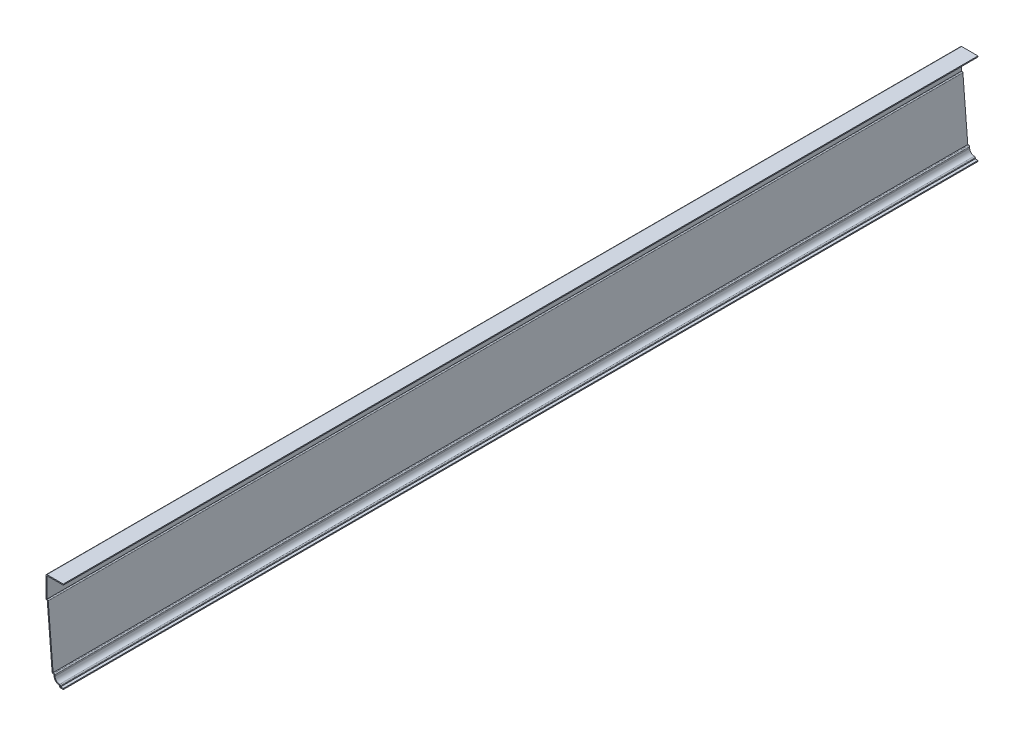
ISO-10303-21;
HEADER;
FILE_DESCRIPTION(('STEP AP214'),'2;1');
FILE_NAME('part.step','',(''),(''),'','','');
FILE_SCHEMA(('AUTOMOTIVE_DESIGN { 1 0 10303 214 1 1 1 1 }'));
ENDSEC;
DATA;
#1=APPLICATION_CONTEXT('core data for automotive mechanical design processes');
#2=APPLICATION_PROTOCOL_DEFINITION('international standard','automotive_design',2000,#1);
#3=PRODUCT_CONTEXT('',#1,'mechanical');
#4=PRODUCT('Part','Part','',(#3));
#5=PRODUCT_RELATED_PRODUCT_CATEGORY('part','',(#4));
#6=PRODUCT_DEFINITION_FORMATION('','',#4);
#7=PRODUCT_DEFINITION_CONTEXT('part definition',#1,'design');
#8=PRODUCT_DEFINITION('design','',#6,#7);
#9=PRODUCT_DEFINITION_SHAPE('','',#8);
#10=(LENGTH_UNIT() NAMED_UNIT(*) SI_UNIT(.MILLI.,.METRE.));
#11=(NAMED_UNIT(*) PLANE_ANGLE_UNIT() SI_UNIT($,.RADIAN.));
#12=(NAMED_UNIT(*) SI_UNIT($,.STERADIAN.) SOLID_ANGLE_UNIT());
#13=UNCERTAINTY_MEASURE_WITH_UNIT(LENGTH_MEASURE(1.E-05),#10,'distance_accuracy_value','');
#14=(GEOMETRIC_REPRESENTATION_CONTEXT(3) GLOBAL_UNCERTAINTY_ASSIGNED_CONTEXT((#13)) GLOBAL_UNIT_ASSIGNED_CONTEXT((#10,
#11,#12)) REPRESENTATION_CONTEXT('',''));
#15=CARTESIAN_POINT('',(0.,0.,0.));
#16=DIRECTION('',(0.,0.,1.));
#17=DIRECTION('',(1.,0.,0.));
#18=AXIS2_PLACEMENT_3D('',#15,#16,#17);
#19=CARTESIAN_POINT('',(-22.225,116.205,-1174.75));
#20=DIRECTION('',(0.,-1.,0.));
#21=DIRECTION('',(0.,0.,-1.));
#22=AXIS2_PLACEMENT_3D('',#19,#20,#21);
#23=PLANE('',#22);
#24=DIRECTION('',(1.,0.,0.));
#25=VECTOR('',#24,1.);
#26=CARTESIAN_POINT('',(-22.225,116.205,0.));
#27=LINE('',#26,#25);
#28=CARTESIAN_POINT('',(-20.955,116.205,0.));
#29=VERTEX_POINT('',#28);
#30=CARTESIAN_POINT('',(0.,116.205,0.));
#31=VERTEX_POINT('',#30);
#32=EDGE_CURVE('E286',#29,#31,#27,.T.);
#33=ORIENTED_EDGE('',*,*,#32,.F.);
#34=DIRECTION('',(0.,0.,1.));
#35=VECTOR('',#34,1.);
#36=CARTESIAN_POINT('',(-20.955,116.205,-1174.75));
#37=LINE('',#36,#35);
#38=CARTESIAN_POINT('',(-20.955,116.205,-1174.75));
#39=VERTEX_POINT('',#38);
#40=EDGE_CURVE('E239',#39,#29,#37,.T.);
#41=ORIENTED_EDGE('',*,*,#40,.F.);
#42=DIRECTION('',(1.,0.,0.));
#43=VECTOR('',#42,1.);
#44=CARTESIAN_POINT('',(-22.225,116.205,-1174.75));
#45=LINE('',#44,#43);
#46=CARTESIAN_POINT('',(0.,116.205,-1174.75));
#47=VERTEX_POINT('',#46);
#48=EDGE_CURVE('E221',#39,#47,#45,.T.);
#49=ORIENTED_EDGE('',*,*,#48,.T.);
#50=DIRECTION('',(0.,0.,1.));
#51=VECTOR('',#50,1.);
#52=CARTESIAN_POINT('',(0.,116.205,-1174.75));
#53=LINE('',#52,#51);
#54=EDGE_CURVE('E229',#47,#31,#53,.T.);
#55=ORIENTED_EDGE('',*,*,#54,.T.);
#56=EDGE_LOOP('',(#33,#41,#49,#55));
#57=FACE_BOUND('',#56,.T.);
#58=ADVANCED_FACE('F35',(#57),#23,.T.);
#59=CARTESIAN_POINT('',(-20.955,88.9,-1174.75));
#60=DIRECTION('',(1.,0.,0.));
#61=DIRECTION('',(0.,1.,0.));
#62=AXIS2_PLACEMENT_3D('',#59,#60,#61);
#63=PLANE('',#62);
#64=DIRECTION('',(0.,1.,0.));
#65=VECTOR('',#64,1.);
#66=CARTESIAN_POINT('',(-20.955,88.9,0.));
#67=LINE('',#66,#65);
#68=CARTESIAN_POINT('',(-20.955,90.17,0.));
#69=VERTEX_POINT('',#68);
#70=EDGE_CURVE('E240',#69,#29,#67,.T.);
#71=ORIENTED_EDGE('',*,*,#70,.F.);
#72=DIRECTION('',(0.,0.,1.));
#73=VECTOR('',#72,1.);
#74=CARTESIAN_POINT('',(-20.955,90.17,-1174.75));
#75=LINE('',#74,#73);
#76=CARTESIAN_POINT('',(-20.955,90.17,-1174.75));
#77=VERTEX_POINT('',#76);
#78=EDGE_CURVE('E331',#77,#69,#75,.T.);
#79=ORIENTED_EDGE('',*,*,#78,.F.);
#80=DIRECTION('',(0.,1.,0.));
#81=VECTOR('',#80,1.);
#82=CARTESIAN_POINT('',(-20.955,88.9,-1174.75));
#83=LINE('',#82,#81);
#84=EDGE_CURVE('E237',#77,#39,#83,.T.);
#85=ORIENTED_EDGE('',*,*,#84,.T.);
#86=ORIENTED_EDGE('',*,*,#40,.T.);
#87=EDGE_LOOP('',(#71,#79,#85,#86));
#88=FACE_BOUND('',#87,.T.);
#89=ADVANCED_FACE('F523',(#88),#63,.T.);
#90=CARTESIAN_POINT('',(-20.6375,90.17,-1174.75));
#91=DIRECTION('',(0.,1.,0.));
#92=DIRECTION('',(0.,0.,1.));
#93=AXIS2_PLACEMENT_3D('',#90,#91,#92);
#94=PLANE('',#93);
#95=DIRECTION('',(1.,0.,0.));
#96=VECTOR('',#95,1.);
#97=CARTESIAN_POINT('',(-20.6375,90.17,0.));
#98=LINE('',#97,#96);
#99=CARTESIAN_POINT('',(-20.6375,90.17,0.));
#100=VERTEX_POINT('',#99);
#101=EDGE_CURVE('E243',#100,#69,#98,.F.);
#102=ORIENTED_EDGE('',*,*,#101,.F.);
#103=DIRECTION('',(0.,0.,1.));
#104=VECTOR('',#103,1.);
#105=CARTESIAN_POINT('',(-20.6375,90.17,-1174.75));
#106=LINE('',#105,#104);
#107=CARTESIAN_POINT('',(-20.6375,90.17,-1174.75));
#108=VERTEX_POINT('',#107);
#109=EDGE_CURVE('E43',#100,#108,#106,.F.);
#110=ORIENTED_EDGE('',*,*,#109,.T.);
#111=DIRECTION('',(1.,0.,0.));
#112=VECTOR('',#111,1.);
#113=CARTESIAN_POINT('',(-20.6375,90.17,-1174.75));
#114=LINE('',#113,#112);
#115=EDGE_CURVE('E283',#108,#77,#114,.F.);
#116=ORIENTED_EDGE('',*,*,#115,.T.);
#117=ORIENTED_EDGE('',*,*,#78,.T.);
#118=EDGE_LOOP('',(#102,#110,#116,#117));
#119=FACE_BOUND('',#118,.T.);
#120=ADVANCED_FACE('F418',(#119),#94,.T.);
#121=CARTESIAN_POINT('',(-13.0217105379053,11.2158297520077,-1174.75));
#122=DIRECTION('',(0.996684615822608,0.0813620094549069,0.));
#123=DIRECTION('',(-0.0813620094549069,0.996684615822608,0.));
#124=AXIS2_PLACEMENT_3D('',#121,#122,#123);
#125=PLANE('',#124);
#126=DIRECTION('',(-0.0813620094549069,0.996684615822608,0.));
#127=VECTOR('',#126,1.);
#128=CARTESIAN_POINT('',(-13.0217105379053,11.2158297520077,-1174.75));
#129=LINE('',#128,#127);
#130=CARTESIAN_POINT('',(-13.1169489254965,12.3825,-1174.75));
#131=VERTEX_POINT('',#130);
#132=CARTESIAN_POINT('',(-19.3717105379053,89.0033297520077,-1174.75));
#133=VERTEX_POINT('',#132);
#134=EDGE_CURVE('E280',#131,#133,#129,.T.);
#135=ORIENTED_EDGE('',*,*,#134,.T.);
#136=DIRECTION('',(0.,0.,1.));
#137=VECTOR('',#136,1.);
#138=CARTESIAN_POINT('',(-19.3717105379053,89.0033297520077,-1174.75));
#139=LINE('',#138,#137);
#140=CARTESIAN_POINT('',(-19.3717105379053,89.0033297520077,0.));
#141=VERTEX_POINT('',#140);
#142=EDGE_CURVE('E412',#133,#141,#139,.T.);
#143=ORIENTED_EDGE('',*,*,#142,.T.);
#144=DIRECTION('',(-0.0813620094549069,0.996684615822608,0.));
#145=VECTOR('',#144,1.);
#146=CARTESIAN_POINT('',(-13.0217105379053,11.2158297520077,0.));
#147=LINE('',#146,#145);
#148=CARTESIAN_POINT('',(-13.1169489254965,12.3825,0.));
#149=VERTEX_POINT('',#148);
#150=EDGE_CURVE('E325',#149,#141,#147,.T.);
#151=ORIENTED_EDGE('',*,*,#150,.F.);
#152=DIRECTION('',(0.,0.,1.));
#153=VECTOR('',#152,1.);
#154=CARTESIAN_POINT('',(-13.1169489254965,12.3825,-1174.75));
#155=LINE('',#154,#153);
#156=EDGE_CURVE('E334',#131,#149,#155,.T.);
#157=ORIENTED_EDGE('',*,*,#156,.F.);
#158=EDGE_LOOP('',(#135,#143,#151,#157));
#159=FACE_BOUND('',#158,.T.);
#160=ADVANCED_FACE('F427',(#159),#125,.T.);
#161=CARTESIAN_POINT('',(-11.90625,12.3825,-1174.75));
#162=DIRECTION('',(0.,1.,0.));
#163=DIRECTION('',(-1.,0.,0.));
#164=AXIS2_PLACEMENT_3D('',#161,#162,#163);
#165=PLANE('',#164);
#166=DIRECTION('',(-1.,0.,0.));
#167=VECTOR('',#166,1.);
#168=CARTESIAN_POINT('',(-11.90625,12.3825,0.));
#169=LINE('',#168,#167);
#170=CARTESIAN_POINT('',(-11.90625,12.3825,0.));
#171=VERTEX_POINT('',#170);
#172=EDGE_CURVE('E323',#171,#149,#169,.T.);
#173=ORIENTED_EDGE('',*,*,#172,.F.);
#174=DIRECTION('',(0.,0.,1.));
#175=VECTOR('',#174,1.);
#176=CARTESIAN_POINT('',(-11.90625,12.3825,-1174.75));
#177=LINE('',#176,#175);
#178=CARTESIAN_POINT('',(-11.90625,12.3825,-1174.75));
#179=VERTEX_POINT('',#178);
#180=EDGE_CURVE('E399',#171,#179,#177,.F.);
#181=ORIENTED_EDGE('',*,*,#180,.T.);
#182=DIRECTION('',(-1.,0.,0.));
#183=VECTOR('',#182,1.);
#184=CARTESIAN_POINT('',(-11.90625,12.3825,-1174.75));
#185=LINE('',#184,#183);
#186=EDGE_CURVE('E278',#179,#131,#185,.T.);
#187=ORIENTED_EDGE('',*,*,#186,.T.);
#188=ORIENTED_EDGE('',*,*,#156,.T.);
#189=EDGE_LOOP('',(#173,#181,#187,#188));
#190=FACE_BOUND('',#189,.T.);
#191=ADVANCED_FACE('F435',(#190),#165,.T.);
#192=CARTESIAN_POINT('',(-10.63625,9.525,-1174.75));
#193=DIRECTION('',(1.,0.,0.));
#194=DIRECTION('',(0.,0.,-1.));
#195=AXIS2_PLACEMENT_3D('',#192,#193,#194);
#196=PLANE('',#195);
#197=DIRECTION('',(0.,1.,0.));
#198=VECTOR('',#197,1.);
#199=CARTESIAN_POINT('',(-10.63625,9.525,-1174.75));
#200=LINE('',#199,#198);
#201=CARTESIAN_POINT('',(-10.63625,9.525,-1174.75));
#202=VERTEX_POINT('',#201);
#203=CARTESIAN_POINT('',(-10.63625,11.1125,-1174.75));
#204=VERTEX_POINT('',#203);
#205=EDGE_CURVE('E275',#202,#204,#200,.T.);
#206=ORIENTED_EDGE('',*,*,#205,.T.);
#207=DIRECTION('',(0.,0.,1.));
#208=VECTOR('',#207,1.);
#209=CARTESIAN_POINT('',(-10.63625,11.1125,-1174.75));
#210=LINE('',#209,#208);
#211=CARTESIAN_POINT('',(-10.63625,11.1125,0.));
#212=VERTEX_POINT('',#211);
#213=EDGE_CURVE('E396',#204,#212,#210,.T.);
#214=ORIENTED_EDGE('',*,*,#213,.T.);
#215=DIRECTION('',(0.,1.,0.));
#216=VECTOR('',#215,1.);
#217=CARTESIAN_POINT('',(-10.63625,9.525,0.));
#218=LINE('',#217,#216);
#219=CARTESIAN_POINT('',(-10.63625,9.525,0.));
#220=VERTEX_POINT('',#219);
#221=EDGE_CURVE('E320',#220,#212,#218,.T.);
#222=ORIENTED_EDGE('',*,*,#221,.F.);
#223=DIRECTION('',(0.,0.,1.));
#224=VECTOR('',#223,1.);
#225=CARTESIAN_POINT('',(-10.63625,9.525,-1174.75));
#226=LINE('',#225,#224);
#227=EDGE_CURVE('E337',#202,#220,#226,.T.);
#228=ORIENTED_EDGE('',*,*,#227,.F.);
#229=EDGE_LOOP('',(#206,#214,#222,#228));
#230=FACE_BOUND('',#229,.T.);
#231=ADVANCED_FACE('F444',(#230),#196,.T.);
#232=CARTESIAN_POINT('',(-4.7625,9.525,-1174.75));
#233=DIRECTION('',(0.,0.,1.));
#234=DIRECTION('',(1.,0.,0.));
#235=AXIS2_PLACEMENT_3D('',#232,#233,#234);
#236=CYLINDRICAL_SURFACE('',#235,5.87375);
#237=CARTESIAN_POINT('',(-4.7625,9.525,0.));
#238=DIRECTION('',(0.,0.,1.));
#239=DIRECTION('',(1.,0.,0.));
#240=AXIS2_PLACEMENT_3D('',#237,#238,#239);
#241=CIRCLE('',#240,5.87375);
#242=CARTESIAN_POINT('',(-4.7625,3.65125,0.));
#243=VERTEX_POINT('',#242);
#244=EDGE_CURVE('E318',#243,#220,#241,.F.);
#245=ORIENTED_EDGE('',*,*,#244,.F.);
#246=DIRECTION('',(0.,0.,1.));
#247=VECTOR('',#246,1.);
#248=CARTESIAN_POINT('',(-4.7625,3.65125,-1174.75));
#249=LINE('',#248,#247);
#250=CARTESIAN_POINT('',(-4.7625,3.65125,-1174.75));
#251=VERTEX_POINT('',#250);
#252=EDGE_CURVE('E394',#243,#251,#249,.F.);
#253=ORIENTED_EDGE('',*,*,#252,.T.);
#254=CARTESIAN_POINT('',(-4.7625,9.525,-1174.75));
#255=DIRECTION('',(0.,0.,1.));
#256=DIRECTION('',(1.,0.,0.));
#257=AXIS2_PLACEMENT_3D('',#254,#255,#256);
#258=CIRCLE('',#257,5.87375);
#259=EDGE_CURVE('E273',#251,#202,#258,.F.);
#260=ORIENTED_EDGE('',*,*,#259,.T.);
#261=ORIENTED_EDGE('',*,*,#227,.T.);
#262=EDGE_LOOP('',(#245,#253,#260,#261));
#263=FACE_BOUND('',#262,.T.);
#264=ADVANCED_FACE('F449',(#263),#236,.F.);
#265=CARTESIAN_POINT('',(-3.4925,0.,-1174.75));
#266=DIRECTION('',(1.,0.,0.));
#267=DIRECTION('',(0.,0.,-1.));
#268=AXIS2_PLACEMENT_3D('',#265,#266,#267);
#269=PLANE('',#268);
#270=DIRECTION('',(0.,1.,0.));
#271=VECTOR('',#270,1.);
#272=CARTESIAN_POINT('',(-3.4925,0.,-1174.75));
#273=LINE('',#272,#271);
#274=CARTESIAN_POINT('',(-3.4925,1.27,-1174.75));
#275=VERTEX_POINT('',#274);
#276=CARTESIAN_POINT('',(-3.4925,2.38125,-1174.75));
#277=VERTEX_POINT('',#276);
#278=EDGE_CURVE('E270',#275,#277,#273,.T.);
#279=ORIENTED_EDGE('',*,*,#278,.T.);
#280=DIRECTION('',(0.,0.,1.));
#281=VECTOR('',#280,1.);
#282=CARTESIAN_POINT('',(-3.4925,2.38125,-1174.75));
#283=LINE('',#282,#281);
#284=CARTESIAN_POINT('',(-3.4925,2.38125,0.));
#285=VERTEX_POINT('',#284);
#286=EDGE_CURVE('E391',#277,#285,#283,.T.);
#287=ORIENTED_EDGE('',*,*,#286,.T.);
#288=DIRECTION('',(0.,1.,0.));
#289=VECTOR('',#288,1.);
#290=CARTESIAN_POINT('',(-3.4925,0.,0.));
#291=LINE('',#290,#289);
#292=CARTESIAN_POINT('',(-3.4925,1.27,0.));
#293=VERTEX_POINT('',#292);
#294=EDGE_CURVE('E315',#293,#285,#291,.T.);
#295=ORIENTED_EDGE('',*,*,#294,.F.);
#296=DIRECTION('',(0.,0.,1.));
#297=VECTOR('',#296,1.);
#298=CARTESIAN_POINT('',(-3.4925,1.27,-1174.75));
#299=LINE('',#298,#297);
#300=EDGE_CURVE('E340',#275,#293,#299,.T.);
#301=ORIENTED_EDGE('',*,*,#300,.F.);
#302=EDGE_LOOP('',(#279,#287,#295,#301));
#303=FACE_BOUND('',#302,.T.);
#304=ADVANCED_FACE('F458',(#303),#269,.T.);
#305=CARTESIAN_POINT('',(0.,1.27,-1174.75));
#306=DIRECTION('',(0.,1.,0.));
#307=DIRECTION('',(-1.,0.,0.));
#308=AXIS2_PLACEMENT_3D('',#305,#306,#307);
#309=PLANE('',#308);
#310=DIRECTION('',(-1.,0.,0.));
#311=VECTOR('',#310,1.);
#312=CARTESIAN_POINT('',(0.,1.27,0.));
#313=LINE('',#312,#311);
#314=CARTESIAN_POINT('',(0.,1.27,0.));
#315=VERTEX_POINT('',#314);
#316=EDGE_CURVE('E312',#315,#293,#313,.T.);
#317=ORIENTED_EDGE('',*,*,#316,.F.);
#318=DIRECTION('',(0.,0.,1.));
#319=VECTOR('',#318,1.);
#320=CARTESIAN_POINT('',(0.,1.27,-1174.75));
#321=LINE('',#320,#319);
#322=CARTESIAN_POINT('',(0.,1.27,-1174.75));
#323=VERTEX_POINT('',#322);
#324=EDGE_CURVE('E342',#323,#315,#321,.T.);
#325=ORIENTED_EDGE('',*,*,#324,.F.);
#326=DIRECTION('',(-1.,0.,0.));
#327=VECTOR('',#326,1.);
#328=CARTESIAN_POINT('',(0.,1.27,-1174.75));
#329=LINE('',#328,#327);
#330=EDGE_CURVE('E267',#323,#275,#329,.T.);
#331=ORIENTED_EDGE('',*,*,#330,.T.);
#332=ORIENTED_EDGE('',*,*,#300,.T.);
#333=EDGE_LOOP('',(#317,#325,#331,#332));
#334=FACE_BOUND('',#333,.T.);
#335=ADVANCED_FACE('F463',(#334),#309,.T.);
#336=CARTESIAN_POINT('',(0.,1.27,-1174.75));
#337=DIRECTION('',(-1.,0.,0.));
#338=DIRECTION('',(0.,-1.,0.));
#339=AXIS2_PLACEMENT_3D('',#336,#337,#338);
#340=PLANE('',#339);
#341=DIRECTION('',(0.,-1.,0.));
#342=VECTOR('',#341,1.);
#343=CARTESIAN_POINT('',(0.,1.27,0.));
#344=LINE('',#343,#342);
#345=CARTESIAN_POINT('',(0.,0.,0.));
#346=VERTEX_POINT('',#345);
#347=EDGE_CURVE('E310',#315,#346,#344,.T.);
#348=ORIENTED_EDGE('',*,*,#347,.T.);
#349=DIRECTION('',(0.,0.,1.));
#350=VECTOR('',#349,1.);
#351=CARTESIAN_POINT('',(0.,0.,-1174.75));
#352=LINE('',#351,#350);
#353=CARTESIAN_POINT('',(0.,0.,-1174.75));
#354=VERTEX_POINT('',#353);
#355=EDGE_CURVE('E344',#354,#346,#352,.T.);
#356=ORIENTED_EDGE('',*,*,#355,.F.);
#357=DIRECTION('',(0.,-1.,0.));
#358=VECTOR('',#357,1.);
#359=CARTESIAN_POINT('',(0.,1.27,-1174.75));
#360=LINE('',#359,#358);
#361=EDGE_CURVE('E265',#323,#354,#360,.T.);
#362=ORIENTED_EDGE('',*,*,#361,.F.);
#363=ORIENTED_EDGE('',*,*,#324,.T.);
#364=EDGE_LOOP('',(#348,#356,#362,#363));
#365=FACE_BOUND('',#364,.T.);
#366=ADVANCED_FACE('F470',(#365),#340,.F.);
#367=CARTESIAN_POINT('',(0.,0.,-1174.75));
#368=DIRECTION('',(0.,1.,0.));
#369=DIRECTION('',(-1.,0.,0.));
#370=AXIS2_PLACEMENT_3D('',#367,#368,#369);
#371=PLANE('',#370);
#372=DIRECTION('',(-1.,0.,0.));
#373=VECTOR('',#372,1.);
#374=CARTESIAN_POINT('',(0.,0.,0.));
#375=LINE('',#374,#373);
#376=CARTESIAN_POINT('',(-3.4925,0.,0.));
#377=VERTEX_POINT('',#376);
#378=EDGE_CURVE('E307',#346,#377,#375,.T.);
#379=ORIENTED_EDGE('',*,*,#378,.T.);
#380=DIRECTION('',(0.,0.,1.));
#381=VECTOR('',#380,1.);
#382=CARTESIAN_POINT('',(-3.4925,0.,-1174.75));
#383=LINE('',#382,#381);
#384=CARTESIAN_POINT('',(-3.4925,0.,-1174.75));
#385=VERTEX_POINT('',#384);
#386=EDGE_CURVE('E376',#377,#385,#383,.F.);
#387=ORIENTED_EDGE('',*,*,#386,.T.);
#388=DIRECTION('',(-1.,0.,0.));
#389=VECTOR('',#388,1.);
#390=CARTESIAN_POINT('',(0.,0.,-1174.75));
#391=LINE('',#390,#389);
#392=EDGE_CURVE('E263',#354,#385,#391,.T.);
#393=ORIENTED_EDGE('',*,*,#392,.F.);
#394=ORIENTED_EDGE('',*,*,#355,.T.);
#395=EDGE_LOOP('',(#379,#387,#393,#394));
#396=FACE_BOUND('',#395,.T.);
#397=ADVANCED_FACE('F472',(#396),#371,.F.);
#398=CARTESIAN_POINT('',(-4.7625,0.,-1174.75));
#399=DIRECTION('',(1.,0.,0.));
#400=DIRECTION('',(0.,0.,-1.));
#401=AXIS2_PLACEMENT_3D('',#398,#399,#400);
#402=PLANE('',#401);
#403=DIRECTION('',(0.,1.,0.));
#404=VECTOR('',#403,1.);
#405=CARTESIAN_POINT('',(-4.7625,0.,-1174.75));
#406=LINE('',#405,#404);
#407=CARTESIAN_POINT('',(-4.7625,1.27,-1174.75));
#408=VERTEX_POINT('',#407);
#409=CARTESIAN_POINT('',(-4.7625,2.38125,-1174.75));
#410=VERTEX_POINT('',#409);
#411=EDGE_CURVE('E261',#408,#410,#406,.T.);
#412=ORIENTED_EDGE('',*,*,#411,.F.);
#413=DIRECTION('',(0.,0.,1.));
#414=VECTOR('',#413,1.);
#415=CARTESIAN_POINT('',(-4.7625,1.27,-1174.75));
#416=LINE('',#415,#414);
#417=CARTESIAN_POINT('',(-4.7625,1.27,0.));
#418=VERTEX_POINT('',#417);
#419=EDGE_CURVE('E330',#408,#418,#416,.T.);
#420=ORIENTED_EDGE('',*,*,#419,.T.);
#421=DIRECTION('',(0.,1.,0.));
#422=VECTOR('',#421,1.);
#423=CARTESIAN_POINT('',(-4.7625,0.,0.));
#424=LINE('',#423,#422);
#425=CARTESIAN_POINT('',(-4.7625,2.38125,0.));
#426=VERTEX_POINT('',#425);
#427=EDGE_CURVE('E305',#418,#426,#424,.T.);
#428=ORIENTED_EDGE('',*,*,#427,.T.);
#429=DIRECTION('',(0.,0.,1.));
#430=VECTOR('',#429,1.);
#431=CARTESIAN_POINT('',(-4.7625,2.38125,-1174.75));
#432=LINE('',#431,#430);
#433=EDGE_CURVE('E347',#410,#426,#432,.T.);
#434=ORIENTED_EDGE('',*,*,#433,.F.);
#435=EDGE_LOOP('',(#412,#420,#428,#434));
#436=FACE_BOUND('',#435,.T.);
#437=ADVANCED_FACE('F480',(#436),#402,.F.);
#438=CARTESIAN_POINT('',(-4.7625,9.525,-1174.75));
#439=DIRECTION('',(0.,0.,1.));
#440=DIRECTION('',(1.,0.,0.));
#441=AXIS2_PLACEMENT_3D('',#438,#439,#440);
#442=CYLINDRICAL_SURFACE('',#441,7.14375);
#443=CARTESIAN_POINT('',(-4.7625,9.525,0.));
#444=DIRECTION('',(0.,0.,-1.));
#445=DIRECTION('',(-1.,0.,0.));
#446=AXIS2_PLACEMENT_3D('',#443,#444,#445);
#447=CIRCLE('',#446,7.14375);
#448=CARTESIAN_POINT('',(-11.90625,9.525,0.));
#449=VERTEX_POINT('',#448);
#450=EDGE_CURVE('E303',#426,#449,#447,.T.);
#451=ORIENTED_EDGE('',*,*,#450,.T.);
#452=DIRECTION('',(0.,0.,1.));
#453=VECTOR('',#452,1.);
#454=CARTESIAN_POINT('',(-11.90625,9.525,-1174.75));
#455=LINE('',#454,#453);
#456=CARTESIAN_POINT('',(-11.90625,9.525,-1174.75));
#457=VERTEX_POINT('',#456);
#458=EDGE_CURVE('E350',#457,#449,#455,.T.);
#459=ORIENTED_EDGE('',*,*,#458,.F.);
#460=CARTESIAN_POINT('',(-4.7625,9.525,-1174.75));
#461=DIRECTION('',(0.,0.,-1.));
#462=DIRECTION('',(-1.,0.,0.));
#463=AXIS2_PLACEMENT_3D('',#460,#461,#462);
#464=CIRCLE('',#463,7.14375);
#465=EDGE_CURVE('E259',#410,#457,#464,.T.);
#466=ORIENTED_EDGE('',*,*,#465,.F.);
#467=ORIENTED_EDGE('',*,*,#433,.T.);
#468=EDGE_LOOP('',(#451,#459,#466,#467));
#469=FACE_BOUND('',#468,.T.);
#470=ADVANCED_FACE('F485',(#469),#442,.T.);
#471=CARTESIAN_POINT('',(-11.90625,9.525,-1174.75));
#472=DIRECTION('',(1.,0.,0.));
#473=DIRECTION('',(0.,0.,-1.));
#474=AXIS2_PLACEMENT_3D('',#471,#472,#473);
#475=PLANE('',#474);
#476=DIRECTION('',(0.,1.,0.));
#477=VECTOR('',#476,1.);
#478=CARTESIAN_POINT('',(-11.90625,9.525,0.));
#479=LINE('',#478,#477);
#480=CARTESIAN_POINT('',(-11.90625,11.1125,0.));
#481=VERTEX_POINT('',#480);
#482=EDGE_CURVE('E301',#449,#481,#479,.T.);
#483=ORIENTED_EDGE('',*,*,#482,.T.);
#484=DIRECTION('',(0.,0.,1.));
#485=VECTOR('',#484,1.);
#486=CARTESIAN_POINT('',(-11.90625,11.1125,-1174.75));
#487=LINE('',#486,#485);
#488=CARTESIAN_POINT('',(-11.90625,11.1125,-1174.75));
#489=VERTEX_POINT('',#488);
#490=EDGE_CURVE('E353',#489,#481,#487,.T.);
#491=ORIENTED_EDGE('',*,*,#490,.F.);
#492=DIRECTION('',(0.,1.,0.));
#493=VECTOR('',#492,1.);
#494=CARTESIAN_POINT('',(-11.90625,9.525,-1174.75));
#495=LINE('',#494,#493);
#496=EDGE_CURVE('E257',#457,#489,#495,.T.);
#497=ORIENTED_EDGE('',*,*,#496,.F.);
#498=ORIENTED_EDGE('',*,*,#458,.T.);
#499=EDGE_LOOP('',(#483,#491,#497,#498));
#500=FACE_BOUND('',#499,.T.);
#501=ADVANCED_FACE('F491',(#500),#475,.F.);
#502=CARTESIAN_POINT('',(-11.90625,11.1125,-1174.75));
#503=DIRECTION('',(0.,1.,0.));
#504=DIRECTION('',(-1.,0.,0.));
#505=AXIS2_PLACEMENT_3D('',#502,#503,#504);
#506=PLANE('',#505);
#507=DIRECTION('',(-1.,0.,0.));
#508=VECTOR('',#507,1.);
#509=CARTESIAN_POINT('',(-11.90625,11.1125,0.));
#510=LINE('',#509,#508);
#511=CARTESIAN_POINT('',(-13.1169489254965,11.1125,0.));
#512=VERTEX_POINT('',#511);
#513=EDGE_CURVE('E298',#481,#512,#510,.T.);
#514=ORIENTED_EDGE('',*,*,#513,.T.);
#515=DIRECTION('',(0.,0.,1.));
#516=VECTOR('',#515,1.);
#517=CARTESIAN_POINT('',(-13.1169489254965,11.1125,-1174.75));
#518=LINE('',#517,#516);
#519=CARTESIAN_POINT('',(-13.1169489254965,11.1125,-1174.75));
#520=VERTEX_POINT('',#519);
#521=EDGE_CURVE('E404',#512,#520,#518,.F.);
#522=ORIENTED_EDGE('',*,*,#521,.T.);
#523=DIRECTION('',(-1.,0.,0.));
#524=VECTOR('',#523,1.);
#525=CARTESIAN_POINT('',(-11.90625,11.1125,-1174.75));
#526=LINE('',#525,#524);
#527=EDGE_CURVE('E254',#489,#520,#526,.T.);
#528=ORIENTED_EDGE('',*,*,#527,.F.);
#529=ORIENTED_EDGE('',*,*,#490,.T.);
#530=EDGE_LOOP('',(#514,#522,#528,#529));
#531=FACE_BOUND('',#530,.T.);
#532=ADVANCED_FACE('F495',(#531),#506,.F.);
#533=CARTESIAN_POINT('',(-14.2875,11.1125,-1174.75));
#534=DIRECTION('',(0.996684615822608,0.0813620094549069,0.));
#535=DIRECTION('',(-0.0813620094549069,0.996684615822608,0.));
#536=AXIS2_PLACEMENT_3D('',#533,#534,#535);
#537=PLANE('',#536);
#538=DIRECTION('',(-0.0813620094549069,0.996684615822608,0.));
#539=VECTOR('',#538,1.);
#540=CARTESIAN_POINT('',(-14.2875,11.1125,-1174.75));
#541=LINE('',#540,#539);
#542=CARTESIAN_POINT('',(-14.3827383875912,12.2791702479923,-1174.75));
#543=VERTEX_POINT('',#542);
#544=CARTESIAN_POINT('',(-20.6375,88.9,-1174.75));
#545=VERTEX_POINT('',#544);
#546=EDGE_CURVE('E252',#543,#545,#541,.T.);
#547=ORIENTED_EDGE('',*,*,#546,.F.);
#548=DIRECTION('',(0.,0.,1.));
#549=VECTOR('',#548,1.);
#550=CARTESIAN_POINT('',(-14.3827383875912,12.2791702479923,-1174.75));
#551=LINE('',#550,#549);
#552=CARTESIAN_POINT('',(-14.3827383875912,12.2791702479923,0.));
#553=VERTEX_POINT('',#552);
#554=EDGE_CURVE('E401',#543,#553,#551,.T.);
#555=ORIENTED_EDGE('',*,*,#554,.T.);
#556=DIRECTION('',(-0.0813620094549069,0.996684615822608,0.));
#557=VECTOR('',#556,1.);
#558=CARTESIAN_POINT('',(-14.2875,11.1125,0.));
#559=LINE('',#558,#557);
#560=CARTESIAN_POINT('',(-20.6375,88.9,0.));
#561=VERTEX_POINT('',#560);
#562=EDGE_CURVE('E296',#553,#561,#559,.T.);
#563=ORIENTED_EDGE('',*,*,#562,.T.);
#564=DIRECTION('',(0.,0.,1.));
#565=VECTOR('',#564,1.);
#566=CARTESIAN_POINT('',(-20.6375,88.9,-1174.75));
#567=LINE('',#566,#565);
#568=EDGE_CURVE('E356',#545,#561,#567,.T.);
#569=ORIENTED_EDGE('',*,*,#568,.F.);
#570=EDGE_LOOP('',(#547,#555,#563,#569));
#571=FACE_BOUND('',#570,.T.);
#572=ADVANCED_FACE('F503',(#571),#537,.F.);
#573=CARTESIAN_POINT('',(-20.6375,88.9,-1174.75));
#574=DIRECTION('',(0.,1.,0.));
#575=DIRECTION('',(0.,0.,1.));
#576=AXIS2_PLACEMENT_3D('',#573,#574,#575);
#577=PLANE('',#576);
#578=DIRECTION('',(-1.,0.,0.));
#579=VECTOR('',#578,1.);
#580=CARTESIAN_POINT('',(-20.6375,88.9,0.));
#581=LINE('',#580,#579);
#582=CARTESIAN_POINT('',(-20.955,88.9,0.));
#583=VERTEX_POINT('',#582);
#584=EDGE_CURVE('E293',#561,#583,#581,.T.);
#585=ORIENTED_EDGE('',*,*,#584,.T.);
#586=DIRECTION('',(0.,0.,1.));
#587=VECTOR('',#586,1.);
#588=CARTESIAN_POINT('',(-20.955,88.9,-1174.75));
#589=LINE('',#588,#587);
#590=CARTESIAN_POINT('',(-20.955,88.9,-1174.75));
#591=VERTEX_POINT('',#590);
#592=EDGE_CURVE('E410',#583,#591,#589,.F.);
#593=ORIENTED_EDGE('',*,*,#592,.T.);
#594=DIRECTION('',(-1.,0.,0.));
#595=VECTOR('',#594,1.);
#596=CARTESIAN_POINT('',(-20.6375,88.9,-1174.75));
#597=LINE('',#596,#595);
#598=EDGE_CURVE('E249',#545,#591,#597,.T.);
#599=ORIENTED_EDGE('',*,*,#598,.F.);
#600=ORIENTED_EDGE('',*,*,#568,.T.);
#601=EDGE_LOOP('',(#585,#593,#599,#600));
#602=FACE_BOUND('',#601,.T.);
#603=ADVANCED_FACE('F508',(#602),#577,.F.);
#604=CARTESIAN_POINT('',(-22.225,88.9,-1174.75));
#605=DIRECTION('',(1.,0.,0.));
#606=DIRECTION('',(0.,1.,0.));
#607=AXIS2_PLACEMENT_3D('',#604,#605,#606);
#608=PLANE('',#607);
#609=DIRECTION('',(0.,1.,0.));
#610=VECTOR('',#609,1.);
#611=CARTESIAN_POINT('',(-22.225,88.9,-1174.75));
#612=LINE('',#611,#610);
#613=CARTESIAN_POINT('',(-22.225,90.17,-1174.75));
#614=VERTEX_POINT('',#613);
#615=CARTESIAN_POINT('',(-22.225,116.205,-1174.75));
#616=VERTEX_POINT('',#615);
#617=EDGE_CURVE('E247',#614,#616,#612,.T.);
#618=ORIENTED_EDGE('',*,*,#617,.F.);
#619=DIRECTION('',(0.,0.,1.));
#620=VECTOR('',#619,1.);
#621=CARTESIAN_POINT('',(-22.225,90.17,-1174.75));
#622=LINE('',#621,#620);
#623=CARTESIAN_POINT('',(-22.225,90.17,0.));
#624=VERTEX_POINT('',#623);
#625=EDGE_CURVE('E407',#614,#624,#622,.T.);
#626=ORIENTED_EDGE('',*,*,#625,.T.);
#627=DIRECTION('',(0.,1.,0.));
#628=VECTOR('',#627,1.);
#629=CARTESIAN_POINT('',(-22.225,88.9,0.));
#630=LINE('',#629,#628);
#631=CARTESIAN_POINT('',(-22.225,116.205,0.));
#632=VERTEX_POINT('',#631);
#633=EDGE_CURVE('E291',#624,#632,#630,.T.);
#634=ORIENTED_EDGE('',*,*,#633,.T.);
#635=DIRECTION('',(0.,0.,1.));
#636=VECTOR('',#635,1.);
#637=CARTESIAN_POINT('',(-22.225,116.205,-1174.75));
#638=LINE('',#637,#636);
#639=EDGE_CURVE('E58',#632,#616,#638,.F.);
#640=ORIENTED_EDGE('',*,*,#639,.T.);
#641=EDGE_LOOP('',(#618,#626,#634,#640));
#642=FACE_BOUND('',#641,.T.);
#643=ADVANCED_FACE('F515',(#642),#608,.F.);
#644=CARTESIAN_POINT('',(-22.225,117.475,-1174.75));
#645=DIRECTION('',(0.,-1.,0.));
#646=DIRECTION('',(0.,0.,-1.));
#647=AXIS2_PLACEMENT_3D('',#644,#645,#646);
#648=PLANE('',#647);
#649=DIRECTION('',(1.,0.,0.));
#650=VECTOR('',#649,1.);
#651=CARTESIAN_POINT('',(-22.225,117.475,-1174.75));
#652=LINE('',#651,#650);
#653=CARTESIAN_POINT('',(-20.955,117.475,-1174.75));
#654=VERTEX_POINT('',#653);
#655=CARTESIAN_POINT('',(0.,117.475,-1174.75));
#656=VERTEX_POINT('',#655);
#657=EDGE_CURVE('E223',#654,#656,#652,.T.);
#658=ORIENTED_EDGE('',*,*,#657,.F.);
#659=DIRECTION('',(0.,0.,1.));
#660=VECTOR('',#659,1.);
#661=CARTESIAN_POINT('',(-20.955,117.475,-1174.75));
#662=LINE('',#661,#660);
#663=CARTESIAN_POINT('',(-20.955,117.475,0.));
#664=VERTEX_POINT('',#663);
#665=EDGE_CURVE('E11',#654,#664,#662,.T.);
#666=ORIENTED_EDGE('',*,*,#665,.T.);
#667=DIRECTION('',(1.,0.,0.));
#668=VECTOR('',#667,1.);
#669=CARTESIAN_POINT('',(-22.225,117.475,0.));
#670=LINE('',#669,#668);
#671=CARTESIAN_POINT('',(0.,117.475,0.));
#672=VERTEX_POINT('',#671);
#673=EDGE_CURVE('E289',#664,#672,#670,.T.);
#674=ORIENTED_EDGE('',*,*,#673,.T.);
#675=DIRECTION('',(0.,0.,1.));
#676=VECTOR('',#675,1.);
#677=CARTESIAN_POINT('',(0.,117.475,-1174.75));
#678=LINE('',#677,#676);
#679=EDGE_CURVE('E236',#656,#672,#678,.T.);
#680=ORIENTED_EDGE('',*,*,#679,.F.);
#681=EDGE_LOOP('',(#658,#666,#674,#680));
#682=FACE_BOUND('',#681,.T.);
#683=ADVANCED_FACE('F520',(#682),#648,.F.);
#684=CARTESIAN_POINT('',(0.,117.475,-1174.75));
#685=DIRECTION('',(-1.,0.,0.));
#686=DIRECTION('',(0.,0.,1.));
#687=AXIS2_PLACEMENT_3D('',#684,#685,#686);
#688=PLANE('',#687);
#689=DIRECTION('',(0.,-1.,0.));
#690=VECTOR('',#689,1.);
#691=CARTESIAN_POINT('',(0.,117.475,0.));
#692=LINE('',#691,#690);
#693=EDGE_CURVE('E232',#672,#31,#692,.T.);
#694=ORIENTED_EDGE('',*,*,#693,.T.);
#695=ORIENTED_EDGE('',*,*,#54,.F.);
#696=DIRECTION('',(0.,-1.,0.));
#697=VECTOR('',#696,1.);
#698=CARTESIAN_POINT('',(0.,117.475,-1174.75));
#699=LINE('',#698,#697);
#700=EDGE_CURVE('E215',#656,#47,#699,.T.);
#701=ORIENTED_EDGE('',*,*,#700,.F.);
#702=ORIENTED_EDGE('',*,*,#679,.T.);
#703=EDGE_LOOP('',(#694,#695,#701,#702));
#704=FACE_BOUND('',#703,.T.);
#705=ADVANCED_FACE('F230',(#704),#688,.F.);
#706=CARTESIAN_POINT('',(-4.7625,9.525,-1174.75));
#707=DIRECTION('',(0.,0.,-1.));
#708=DIRECTION('',(-1.,0.,0.));
#709=AXIS2_PLACEMENT_3D('',#706,#707,#708);
#710=PLANE('',#709);
#711=ORIENTED_EDGE('',*,*,#392,.T.);
#712=CARTESIAN_POINT('',(-3.4925,1.27,-1174.75));
#713=DIRECTION('',(0.,0.,-1.));
#714=DIRECTION('',(-1.,0.,0.));
#715=AXIS2_PLACEMENT_3D('',#712,#713,#714);
#716=CIRCLE('',#715,1.27);
#717=EDGE_CURVE('E389',#385,#408,#716,.T.);
#718=ORIENTED_EDGE('',*,*,#717,.T.);
#719=ORIENTED_EDGE('',*,*,#411,.T.);
#720=ORIENTED_EDGE('',*,*,#465,.T.);
#721=ORIENTED_EDGE('',*,*,#496,.T.);
#722=ORIENTED_EDGE('',*,*,#527,.T.);
#723=CARTESIAN_POINT('',(-13.1169489254965,12.3825,-1174.75));
#724=DIRECTION('',(0.,0.,-1.));
#725=DIRECTION('',(-1.,0.,0.));
#726=AXIS2_PLACEMENT_3D('',#723,#724,#725);
#727=CIRCLE('',#726,1.27);
#728=EDGE_CURVE('E383',#520,#543,#727,.T.);
#729=ORIENTED_EDGE('',*,*,#728,.T.);
#730=ORIENTED_EDGE('',*,*,#546,.T.);
#731=ORIENTED_EDGE('',*,*,#598,.T.);
#732=CARTESIAN_POINT('',(-20.955,90.17,-1174.75));
#733=DIRECTION('',(0.,0.,-1.));
#734=DIRECTION('',(-1.,0.,0.));
#735=AXIS2_PLACEMENT_3D('',#732,#733,#734);
#736=CIRCLE('',#735,1.27);
#737=EDGE_CURVE('E381',#591,#614,#736,.T.);
#738=ORIENTED_EDGE('',*,*,#737,.T.);
#739=ORIENTED_EDGE('',*,*,#617,.T.);
#740=CARTESIAN_POINT('',(-20.955,116.205,-1174.75));
#741=DIRECTION('',(0.,0.,-1.));
#742=DIRECTION('',(-1.,0.,0.));
#743=AXIS2_PLACEMENT_3D('',#740,#741,#742);
#744=CIRCLE('',#743,1.27);
#745=EDGE_CURVE('E50',#616,#654,#744,.T.);
#746=ORIENTED_EDGE('',*,*,#745,.T.);
#747=ORIENTED_EDGE('',*,*,#657,.T.);
#748=ORIENTED_EDGE('',*,*,#700,.T.);
#749=ORIENTED_EDGE('',*,*,#48,.F.);
#750=ORIENTED_EDGE('',*,*,#84,.F.);
#751=ORIENTED_EDGE('',*,*,#115,.F.);
#752=CARTESIAN_POINT('',(-20.6375,88.9,-1174.75));
#753=DIRECTION('',(0.,0.,-1.));
#754=DIRECTION('',(-1.,0.,0.));
#755=AXIS2_PLACEMENT_3D('',#752,#753,#754);
#756=CIRCLE('',#755,1.27);
#757=EDGE_CURVE('E379',#108,#133,#756,.T.);
#758=ORIENTED_EDGE('',*,*,#757,.T.);
#759=ORIENTED_EDGE('',*,*,#134,.F.);
#760=ORIENTED_EDGE('',*,*,#186,.F.);
#761=CARTESIAN_POINT('',(-11.90625,11.1125,-1174.75));
#762=DIRECTION('',(0.,0.,-1.));
#763=DIRECTION('',(-1.,0.,0.));
#764=AXIS2_PLACEMENT_3D('',#761,#762,#763);
#765=CIRCLE('',#764,1.27);
#766=EDGE_CURVE('E385',#179,#204,#765,.T.);
#767=ORIENTED_EDGE('',*,*,#766,.T.);
#768=ORIENTED_EDGE('',*,*,#205,.F.);
#769=ORIENTED_EDGE('',*,*,#259,.F.);
#770=CARTESIAN_POINT('',(-4.7625,2.38125,-1174.75));
#771=DIRECTION('',(0.,0.,-1.));
#772=DIRECTION('',(-1.,0.,0.));
#773=AXIS2_PLACEMENT_3D('',#770,#771,#772);
#774=CIRCLE('',#773,1.27);
#775=EDGE_CURVE('E387',#251,#277,#774,.T.);
#776=ORIENTED_EDGE('',*,*,#775,.T.);
#777=ORIENTED_EDGE('',*,*,#278,.F.);
#778=ORIENTED_EDGE('',*,*,#330,.F.);
#779=ORIENTED_EDGE('',*,*,#361,.T.);
#780=EDGE_LOOP('',(#711,#718,#719,#720,#721,#722,#729,#730,#731,#738,#739,#746,#747,#748,#749,
#750,#751,#758,#759,#760,#767,#768,#769,#776,#777,#778,#779));
#781=FACE_BOUND('',#780,.T.);
#782=ADVANCED_FACE('F218',(#781),#710,.T.);
#783=CARTESIAN_POINT('',(-4.7625,9.525,0.));
#784=DIRECTION('',(0.,0.,-1.));
#785=DIRECTION('',(-1.,0.,0.));
#786=AXIS2_PLACEMENT_3D('',#783,#784,#785);
#787=PLANE('',#786);
#788=ORIENTED_EDGE('',*,*,#427,.F.);
#789=CARTESIAN_POINT('',(-3.4925,1.27,0.));
#790=DIRECTION('',(0.,0.,-1.));
#791=DIRECTION('',(-1.,0.,0.));
#792=AXIS2_PLACEMENT_3D('',#789,#790,#791);
#793=CIRCLE('',#792,1.27);
#794=EDGE_CURVE('E374',#418,#377,#793,.F.);
#795=ORIENTED_EDGE('',*,*,#794,.T.);
#796=ORIENTED_EDGE('',*,*,#378,.F.);
#797=ORIENTED_EDGE('',*,*,#347,.F.);
#798=ORIENTED_EDGE('',*,*,#316,.T.);
#799=ORIENTED_EDGE('',*,*,#294,.T.);
#800=CARTESIAN_POINT('',(-4.7625,2.38125,0.));
#801=DIRECTION('',(0.,0.,-1.));
#802=DIRECTION('',(-1.,0.,0.));
#803=AXIS2_PLACEMENT_3D('',#800,#801,#802);
#804=CIRCLE('',#803,1.27);
#805=EDGE_CURVE('E372',#285,#243,#804,.F.);
#806=ORIENTED_EDGE('',*,*,#805,.T.);
#807=ORIENTED_EDGE('',*,*,#244,.T.);
#808=ORIENTED_EDGE('',*,*,#221,.T.);
#809=CARTESIAN_POINT('',(-11.90625,11.1125,0.));
#810=DIRECTION('',(0.,0.,-1.));
#811=DIRECTION('',(-1.,0.,0.));
#812=AXIS2_PLACEMENT_3D('',#809,#810,#811);
#813=CIRCLE('',#812,1.27);
#814=EDGE_CURVE('E370',#212,#171,#813,.F.);
#815=ORIENTED_EDGE('',*,*,#814,.T.);
#816=ORIENTED_EDGE('',*,*,#172,.T.);
#817=ORIENTED_EDGE('',*,*,#150,.T.);
#818=CARTESIAN_POINT('',(-20.6375,88.9,0.));
#819=DIRECTION('',(0.,0.,-1.));
#820=DIRECTION('',(-1.,0.,0.));
#821=AXIS2_PLACEMENT_3D('',#818,#819,#820);
#822=CIRCLE('',#821,1.27);
#823=EDGE_CURVE('E364',#141,#100,#822,.F.);
#824=ORIENTED_EDGE('',*,*,#823,.T.);
#825=ORIENTED_EDGE('',*,*,#101,.T.);
#826=ORIENTED_EDGE('',*,*,#70,.T.);
#827=ORIENTED_EDGE('',*,*,#32,.T.);
#828=ORIENTED_EDGE('',*,*,#693,.F.);
#829=ORIENTED_EDGE('',*,*,#673,.F.);
#830=CARTESIAN_POINT('',(-20.955,116.205,0.));
#831=DIRECTION('',(0.,0.,-1.));
#832=DIRECTION('',(-1.,0.,0.));
#833=AXIS2_PLACEMENT_3D('',#830,#831,#832);
#834=CIRCLE('',#833,1.27);
#835=EDGE_CURVE('E362',#664,#632,#834,.F.);
#836=ORIENTED_EDGE('',*,*,#835,.T.);
#837=ORIENTED_EDGE('',*,*,#633,.F.);
#838=CARTESIAN_POINT('',(-20.955,90.17,0.));
#839=DIRECTION('',(0.,0.,-1.));
#840=DIRECTION('',(-1.,0.,0.));
#841=AXIS2_PLACEMENT_3D('',#838,#839,#840);
#842=CIRCLE('',#841,1.27);
#843=EDGE_CURVE('E366',#624,#583,#842,.F.);
#844=ORIENTED_EDGE('',*,*,#843,.T.);
#845=ORIENTED_EDGE('',*,*,#584,.F.);
#846=ORIENTED_EDGE('',*,*,#562,.F.);
#847=CARTESIAN_POINT('',(-13.1169489254965,12.3825,0.));
#848=DIRECTION('',(0.,0.,-1.));
#849=DIRECTION('',(-1.,0.,0.));
#850=AXIS2_PLACEMENT_3D('',#847,#848,#849);
#851=CIRCLE('',#850,1.27);
#852=EDGE_CURVE('E368',#553,#512,#851,.F.);
#853=ORIENTED_EDGE('',*,*,#852,.T.);
#854=ORIENTED_EDGE('',*,*,#513,.F.);
#855=ORIENTED_EDGE('',*,*,#482,.F.);
#856=ORIENTED_EDGE('',*,*,#450,.F.);
#857=EDGE_LOOP('',(#788,#795,#796,#797,#798,#799,#806,#807,#808,#815,#816,#817,#824,#825,#826,
#827,#828,#829,#836,#837,#844,#845,#846,#853,#854,#855,#856));
#858=FACE_BOUND('',#857,.T.);
#859=ADVANCED_FACE('F431',(#858),#787,.F.);
#860=CARTESIAN_POINT('',(-3.4925,1.27,-1174.75));
#861=DIRECTION('',(0.,0.,1.));
#862=DIRECTION('',(1.,0.,0.));
#863=AXIS2_PLACEMENT_3D('',#860,#861,#862);
#864=CYLINDRICAL_SURFACE('',#863,1.27);
#865=ORIENTED_EDGE('',*,*,#717,.F.);
#866=ORIENTED_EDGE('',*,*,#386,.F.);
#867=ORIENTED_EDGE('',*,*,#794,.F.);
#868=ORIENTED_EDGE('',*,*,#419,.F.);
#869=EDGE_LOOP('',(#865,#866,#867,#868));
#870=FACE_BOUND('',#869,.T.);
#871=ADVANCED_FACE('F475',(#870),#864,.T.);
#872=CARTESIAN_POINT('',(-4.7625,2.38125,-1174.75));
#873=DIRECTION('',(0.,0.,1.));
#874=DIRECTION('',(1.,0.,0.));
#875=AXIS2_PLACEMENT_3D('',#872,#873,#874);
#876=CYLINDRICAL_SURFACE('',#875,1.27);
#877=ORIENTED_EDGE('',*,*,#775,.F.);
#878=ORIENTED_EDGE('',*,*,#252,.F.);
#879=ORIENTED_EDGE('',*,*,#805,.F.);
#880=ORIENTED_EDGE('',*,*,#286,.F.);
#881=EDGE_LOOP('',(#877,#878,#879,#880));
#882=FACE_BOUND('',#881,.T.);
#883=ADVANCED_FACE('F455',(#882),#876,.T.);
#884=CARTESIAN_POINT('',(-11.90625,11.1125,-1174.75));
#885=DIRECTION('',(0.,0.,1.));
#886=DIRECTION('',(1.,0.,0.));
#887=AXIS2_PLACEMENT_3D('',#884,#885,#886);
#888=CYLINDRICAL_SURFACE('',#887,1.27);
#889=ORIENTED_EDGE('',*,*,#766,.F.);
#890=ORIENTED_EDGE('',*,*,#180,.F.);
#891=ORIENTED_EDGE('',*,*,#814,.F.);
#892=ORIENTED_EDGE('',*,*,#213,.F.);
#893=EDGE_LOOP('',(#889,#890,#891,#892));
#894=FACE_BOUND('',#893,.T.);
#895=ADVANCED_FACE('F441',(#894),#888,.T.);
#896=CARTESIAN_POINT('',(-13.1169489254965,12.3825,-1174.75));
#897=DIRECTION('',(0.,0.,1.));
#898=DIRECTION('',(1.,0.,0.));
#899=AXIS2_PLACEMENT_3D('',#896,#897,#898);
#900=CYLINDRICAL_SURFACE('',#899,1.27);
#901=ORIENTED_EDGE('',*,*,#728,.F.);
#902=ORIENTED_EDGE('',*,*,#521,.F.);
#903=ORIENTED_EDGE('',*,*,#852,.F.);
#904=ORIENTED_EDGE('',*,*,#554,.F.);
#905=EDGE_LOOP('',(#901,#902,#903,#904));
#906=FACE_BOUND('',#905,.T.);
#907=ADVANCED_FACE('F498',(#906),#900,.T.);
#908=CARTESIAN_POINT('',(-20.955,90.17,-1174.75));
#909=DIRECTION('',(0.,0.,1.));
#910=DIRECTION('',(1.,0.,0.));
#911=AXIS2_PLACEMENT_3D('',#908,#909,#910);
#912=CYLINDRICAL_SURFACE('',#911,1.27);
#913=ORIENTED_EDGE('',*,*,#737,.F.);
#914=ORIENTED_EDGE('',*,*,#592,.F.);
#915=ORIENTED_EDGE('',*,*,#843,.F.);
#916=ORIENTED_EDGE('',*,*,#625,.F.);
#917=EDGE_LOOP('',(#913,#914,#915,#916));
#918=FACE_BOUND('',#917,.T.);
#919=ADVANCED_FACE('F513',(#918),#912,.T.);
#920=CARTESIAN_POINT('',(-20.6375,88.9,-1174.75));
#921=DIRECTION('',(0.,0.,1.));
#922=DIRECTION('',(1.,0.,0.));
#923=AXIS2_PLACEMENT_3D('',#920,#921,#922);
#924=CYLINDRICAL_SURFACE('',#923,1.27);
#925=ORIENTED_EDGE('',*,*,#757,.F.);
#926=ORIENTED_EDGE('',*,*,#109,.F.);
#927=ORIENTED_EDGE('',*,*,#823,.F.);
#928=ORIENTED_EDGE('',*,*,#142,.F.);
#929=EDGE_LOOP('',(#925,#926,#927,#928));
#930=FACE_BOUND('',#929,.T.);
#931=ADVANCED_FACE('F424',(#930),#924,.T.);
#932=CARTESIAN_POINT('',(-20.955,116.205,-1174.75));
#933=DIRECTION('',(0.,0.,1.));
#934=DIRECTION('',(1.,0.,0.));
#935=AXIS2_PLACEMENT_3D('',#932,#933,#934);
#936=CYLINDRICAL_SURFACE('',#935,1.27);
#937=ORIENTED_EDGE('',*,*,#745,.F.);
#938=ORIENTED_EDGE('',*,*,#639,.F.);
#939=ORIENTED_EDGE('',*,*,#835,.F.);
#940=ORIENTED_EDGE('',*,*,#665,.F.);
#941=EDGE_LOOP('',(#937,#938,#939,#940));
#942=FACE_BOUND('',#941,.T.);
#943=ADVANCED_FACE('F37',(#942),#936,.T.);
#944=CLOSED_SHELL('',(#58,#89,#120,#160,#191,#231,#264,#304,#335,#366,#397,#437,#470,#501,#532,
#572,#603,#643,#683,#705,#782,#859,#871,#883,#895,#907,#919,#931,#943));
#945=MANIFOLD_SOLID_BREP('B2',#944);
#946=ADVANCED_BREP_SHAPE_REPRESENTATION('',(#18,#945),#14);
#947=SHAPE_DEFINITION_REPRESENTATION(#9,#946);
ENDSEC;
END-ISO-10303-21;
